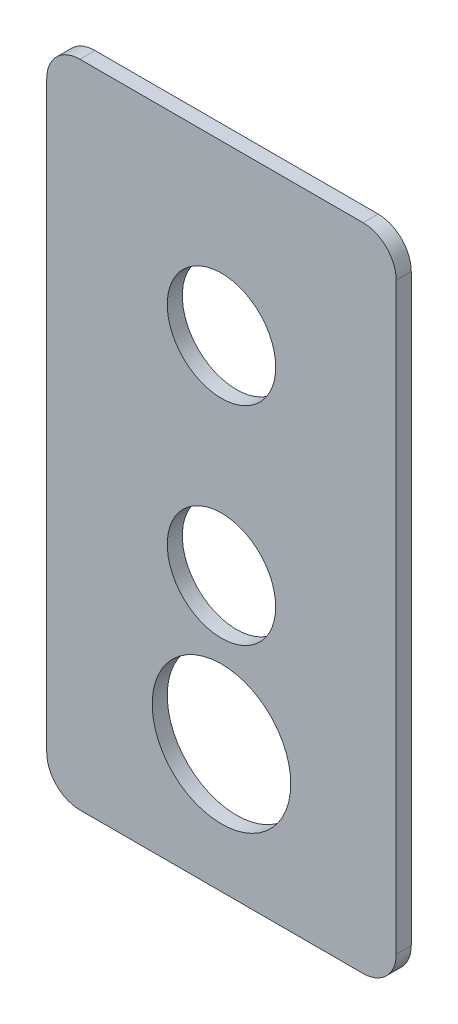
ISO-10303-21;
HEADER;
FILE_DESCRIPTION(('STEP AP214'),'2;1');
FILE_NAME('part.step','',(''),(''),'','','');
FILE_SCHEMA(('AUTOMOTIVE_DESIGN { 1 0 10303 214 1 1 1 1 }'));
ENDSEC;
DATA;
#1=APPLICATION_CONTEXT('core data for automotive mechanical design processes');
#2=APPLICATION_PROTOCOL_DEFINITION('international standard','automotive_design',2000,#1);
#3=PRODUCT_CONTEXT('',#1,'mechanical');
#4=PRODUCT('Part','Part','',(#3));
#5=PRODUCT_RELATED_PRODUCT_CATEGORY('part','',(#4));
#6=PRODUCT_DEFINITION_FORMATION('','',#4);
#7=PRODUCT_DEFINITION_CONTEXT('part definition',#1,'design');
#8=PRODUCT_DEFINITION('design','',#6,#7);
#9=PRODUCT_DEFINITION_SHAPE('','',#8);
#10=(LENGTH_UNIT() NAMED_UNIT(*) SI_UNIT(.MILLI.,.METRE.));
#11=(NAMED_UNIT(*) PLANE_ANGLE_UNIT() SI_UNIT($,.RADIAN.));
#12=(NAMED_UNIT(*) SI_UNIT($,.STERADIAN.) SOLID_ANGLE_UNIT());
#13=UNCERTAINTY_MEASURE_WITH_UNIT(LENGTH_MEASURE(1.E-05),#10,'distance_accuracy_value','');
#14=(GEOMETRIC_REPRESENTATION_CONTEXT(3) GLOBAL_UNCERTAINTY_ASSIGNED_CONTEXT((#13)) GLOBAL_UNIT_ASSIGNED_CONTEXT((#10,
#11,#12)) REPRESENTATION_CONTEXT('',''));
#15=CARTESIAN_POINT('',(0.,0.,0.));
#16=DIRECTION('',(0.,0.,1.));
#17=DIRECTION('',(1.,0.,0.));
#18=AXIS2_PLACEMENT_3D('',#15,#16,#17);
#19=CARTESIAN_POINT('',(-6.96028156084457,107.92,0.772727272727271));
#20=DIRECTION('',(1.,0.,0.));
#21=DIRECTION('',(0.,0.,-1.));
#22=AXIS2_PLACEMENT_3D('',#19,#20,#21);
#23=PLANE('',#22);
#24=DIRECTION('',(0.,-1.,0.));
#25=VECTOR('',#24,1.);
#26=CARTESIAN_POINT('',(-6.96028156084457,107.92,0.772727272727271));
#27=LINE('',#26,#25);
#28=CARTESIAN_POINT('',(-6.96028156084457,102.42,0.772727272727271));
#29=VERTEX_POINT('',#28);
#30=CARTESIAN_POINT('',(-6.96028156084457,5.50000000000001,0.772727272727271));
#31=VERTEX_POINT('',#30);
#32=EDGE_CURVE('E124',#29,#31,#27,.T.);
#33=ORIENTED_EDGE('',*,*,#32,.T.);
#34=DIRECTION('',(0.,0.,1.));
#35=VECTOR('',#34,1.);
#36=CARTESIAN_POINT('',(-6.96028156084457,5.50000000000001,0.772727272727271));
#37=LINE('',#36,#35);
#38=CARTESIAN_POINT('',(-6.96028156084457,5.50000000000001,3.27272727272727));
#39=VERTEX_POINT('',#38);
#40=EDGE_CURVE('E150',#31,#39,#37,.T.);
#41=ORIENTED_EDGE('',*,*,#40,.T.);
#42=DIRECTION('',(0.,-1.,0.));
#43=VECTOR('',#42,1.);
#44=CARTESIAN_POINT('',(-6.96028156084457,107.92,3.27272727272727));
#45=LINE('',#44,#43);
#46=CARTESIAN_POINT('',(-6.96028156084457,102.42,3.27272727272727));
#47=VERTEX_POINT('',#46);
#48=EDGE_CURVE('E128',#47,#39,#45,.T.);
#49=ORIENTED_EDGE('',*,*,#48,.F.);
#50=DIRECTION('',(0.,0.,1.));
#51=VECTOR('',#50,1.);
#52=CARTESIAN_POINT('',(-6.96028156084457,102.42,0.772727272727271));
#53=LINE('',#52,#51);
#54=EDGE_CURVE('E148',#47,#29,#53,.F.);
#55=ORIENTED_EDGE('',*,*,#54,.T.);
#56=EDGE_LOOP('',(#33,#41,#49,#55));
#57=FACE_BOUND('',#56,.T.);
#58=ADVANCED_FACE('F34',(#57),#23,.F.);
#59=CARTESIAN_POINT('',(-6.96028156084457,107.92,3.27272727272727));
#60=DIRECTION('',(0.,0.,-1.));
#61=DIRECTION('',(-1.,0.,0.));
#62=AXIS2_PLACEMENT_3D('',#59,#60,#61);
#63=PLANE('',#62);
#64=CARTESIAN_POINT('',(22.0397184391554,21.2424,3.27272727272727));
#65=DIRECTION('',(0.,0.,1.));
#66=DIRECTION('',(1.,0.,0.));
#67=AXIS2_PLACEMENT_3D('',#64,#65,#66);
#68=CIRCLE('',#67,11.5);
#69=CARTESIAN_POINT('',(33.5397184391554,21.2424,3.27272727272727));
#70=VERTEX_POINT('',#69);
#71=EDGE_CURVE('E197',#70,#70,#68,.T.);
#72=ORIENTED_EDGE('',*,*,#71,.F.);
#73=EDGE_LOOP('',(#72));
#74=FACE_BOUND('',#73,.T.);
#75=CARTESIAN_POINT('',(22.0397184391554,79.92,3.27272727272727));
#76=DIRECTION('',(0.,0.,1.));
#77=DIRECTION('',(1.,0.,0.));
#78=AXIS2_PLACEMENT_3D('',#75,#76,#77);
#79=CIRCLE('',#78,9.);
#80=CARTESIAN_POINT('',(31.0397184391554,79.92,3.27272727272727));
#81=VERTEX_POINT('',#80);
#82=EDGE_CURVE('E156',#81,#81,#79,.T.);
#83=ORIENTED_EDGE('',*,*,#82,.F.);
#84=EDGE_LOOP('',(#83));
#85=FACE_BOUND('',#84,.T.);
#86=CARTESIAN_POINT('',(22.0397184391554,45.4387,3.27272727272727));
#87=DIRECTION('',(0.,0.,1.));
#88=DIRECTION('',(1.,0.,0.));
#89=AXIS2_PLACEMENT_3D('',#86,#87,#88);
#90=CIRCLE('',#89,9.00000000000001);
#91=CARTESIAN_POINT('',(31.0397184391554,45.4387,3.27272727272727));
#92=VERTEX_POINT('',#91);
#93=EDGE_CURVE('E192',#92,#92,#90,.T.);
#94=ORIENTED_EDGE('',*,*,#93,.F.);
#95=EDGE_LOOP('',(#94));
#96=FACE_BOUND('',#95,.T.);
#97=DIRECTION('',(1.,0.,0.));
#98=VECTOR('',#97,1.);
#99=CARTESIAN_POINT('',(-6.96028156084457,0.,3.27272727272727));
#100=LINE('',#99,#98);
#101=CARTESIAN_POINT('',(-1.46028156084457,0.,3.27272727272727));
#102=VERTEX_POINT('',#101);
#103=CARTESIAN_POINT('',(45.5397184391554,0.,3.27272727272727));
#104=VERTEX_POINT('',#103);
#105=EDGE_CURVE('E158',#102,#104,#100,.T.);
#106=ORIENTED_EDGE('',*,*,#105,.T.);
#107=CARTESIAN_POINT('',(45.5397184391554,5.50000000000001,3.27272727272727));
#108=DIRECTION('',(0.,0.,-1.));
#109=DIRECTION('',(-1.,0.,0.));
#110=AXIS2_PLACEMENT_3D('',#107,#108,#109);
#111=CIRCLE('',#110,5.5);
#112=CARTESIAN_POINT('',(51.0397184391554,5.50000000000001,3.27272727272727));
#113=VERTEX_POINT('',#112);
#114=EDGE_CURVE('E146',#104,#113,#111,.F.);
#115=ORIENTED_EDGE('',*,*,#114,.T.);
#116=DIRECTION('',(0.,-1.,0.));
#117=VECTOR('',#116,1.);
#118=CARTESIAN_POINT('',(51.0397184391554,107.92,3.27272727272727));
#119=LINE('',#118,#117);
#120=CARTESIAN_POINT('',(51.0397184391554,102.42,3.27272727272727));
#121=VERTEX_POINT('',#120);
#122=EDGE_CURVE('E123',#121,#113,#119,.T.);
#123=ORIENTED_EDGE('',*,*,#122,.F.);
#124=CARTESIAN_POINT('',(45.5397184391554,102.42,3.27272727272727));
#125=DIRECTION('',(0.,0.,-1.));
#126=DIRECTION('',(-1.,0.,0.));
#127=AXIS2_PLACEMENT_3D('',#124,#125,#126);
#128=CIRCLE('',#127,5.5);
#129=CARTESIAN_POINT('',(45.5397184391554,107.92,3.27272727272727));
#130=VERTEX_POINT('',#129);
#131=EDGE_CURVE('E127',#121,#130,#128,.F.);
#132=ORIENTED_EDGE('',*,*,#131,.T.);
#133=DIRECTION('',(1.,0.,0.));
#134=VECTOR('',#133,1.);
#135=CARTESIAN_POINT('',(-6.96028156084457,107.92,3.27272727272727));
#136=LINE('',#135,#134);
#137=CARTESIAN_POINT('',(-1.46028156084457,107.92,3.27272727272727));
#138=VERTEX_POINT('',#137);
#139=EDGE_CURVE('E167',#138,#130,#136,.T.);
#140=ORIENTED_EDGE('',*,*,#139,.F.);
#141=CARTESIAN_POINT('',(-1.46028156084457,102.42,3.27272727272727));
#142=DIRECTION('',(0.,0.,-1.));
#143=DIRECTION('',(-1.,0.,0.));
#144=AXIS2_PLACEMENT_3D('',#141,#142,#143);
#145=CIRCLE('',#144,5.5);
#146=EDGE_CURVE('E59',#138,#47,#145,.F.);
#147=ORIENTED_EDGE('',*,*,#146,.T.);
#148=ORIENTED_EDGE('',*,*,#48,.T.);
#149=CARTESIAN_POINT('',(-1.46028156084457,5.50000000000001,3.27272727272727));
#150=DIRECTION('',(0.,0.,-1.));
#151=DIRECTION('',(-1.,0.,0.));
#152=AXIS2_PLACEMENT_3D('',#149,#150,#151);
#153=CIRCLE('',#152,5.5);
#154=EDGE_CURVE('E51',#39,#102,#153,.F.);
#155=ORIENTED_EDGE('',*,*,#154,.T.);
#156=EDGE_LOOP('',(#106,#115,#123,#132,#140,#147,#148,#155));
#157=FACE_BOUND('',#156,.T.);
#158=ADVANCED_FACE('F216',(#74,#85,#96,#157),#63,.F.);
#159=CARTESIAN_POINT('',(51.0397184391554,107.92,0.772727272727271));
#160=DIRECTION('',(-1.,0.,0.));
#161=DIRECTION('',(0.,0.,1.));
#162=AXIS2_PLACEMENT_3D('',#159,#160,#161);
#163=PLANE('',#162);
#164=ORIENTED_EDGE('',*,*,#122,.T.);
#165=DIRECTION('',(0.,0.,-1.));
#166=VECTOR('',#165,1.);
#167=CARTESIAN_POINT('',(51.0397184391554,5.50000000000001,0.772727272727271));
#168=LINE('',#167,#166);
#169=CARTESIAN_POINT('',(51.0397184391554,5.50000000000001,0.772727272727271));
#170=VERTEX_POINT('',#169);
#171=EDGE_CURVE('E114',#113,#170,#168,.T.);
#172=ORIENTED_EDGE('',*,*,#171,.T.);
#173=DIRECTION('',(0.,-1.,0.));
#174=VECTOR('',#173,1.);
#175=CARTESIAN_POINT('',(51.0397184391554,107.92,0.772727272727271));
#176=LINE('',#175,#174);
#177=CARTESIAN_POINT('',(51.0397184391554,102.42,0.772727272727271));
#178=VERTEX_POINT('',#177);
#179=EDGE_CURVE('E106',#178,#170,#176,.T.);
#180=ORIENTED_EDGE('',*,*,#179,.F.);
#181=DIRECTION('',(0.,0.,-1.));
#182=VECTOR('',#181,1.);
#183=CARTESIAN_POINT('',(51.0397184391554,102.42,3.27272727272727));
#184=LINE('',#183,#182);
#185=EDGE_CURVE('E120',#178,#121,#184,.F.);
#186=ORIENTED_EDGE('',*,*,#185,.T.);
#187=EDGE_LOOP('',(#164,#172,#180,#186));
#188=FACE_BOUND('',#187,.T.);
#189=ADVANCED_FACE('F119',(#188),#163,.F.);
#190=CARTESIAN_POINT('',(-6.96028156084457,107.92,0.772727272727271));
#191=DIRECTION('',(0.,0.,1.));
#192=DIRECTION('',(1.,0.,0.));
#193=AXIS2_PLACEMENT_3D('',#190,#191,#192);
#194=PLANE('',#193);
#195=CARTESIAN_POINT('',(22.0397184391554,21.2424,0.772727272727272));
#196=DIRECTION('',(0.,0.,1.));
#197=DIRECTION('',(1.,0.,0.));
#198=AXIS2_PLACEMENT_3D('',#195,#196,#197);
#199=CIRCLE('',#198,11.5);
#200=CARTESIAN_POINT('',(33.5397184391554,21.2424,0.772727272727272));
#201=VERTEX_POINT('',#200);
#202=EDGE_CURVE('E38',#201,#201,#199,.T.);
#203=ORIENTED_EDGE('',*,*,#202,.T.);
#204=EDGE_LOOP('',(#203));
#205=FACE_BOUND('',#204,.T.);
#206=CARTESIAN_POINT('',(22.0397184391554,79.92,0.772727272727272));
#207=DIRECTION('',(0.,0.,1.));
#208=DIRECTION('',(1.,0.,0.));
#209=AXIS2_PLACEMENT_3D('',#206,#207,#208);
#210=CIRCLE('',#209,9.);
#211=CARTESIAN_POINT('',(31.0397184391554,79.92,0.772727272727272));
#212=VERTEX_POINT('',#211);
#213=EDGE_CURVE('E155',#212,#212,#210,.T.);
#214=ORIENTED_EDGE('',*,*,#213,.T.);
#215=EDGE_LOOP('',(#214));
#216=FACE_BOUND('',#215,.T.);
#217=CARTESIAN_POINT('',(22.0397184391554,45.4387,0.772727272727272));
#218=DIRECTION('',(0.,0.,1.));
#219=DIRECTION('',(1.,0.,0.));
#220=AXIS2_PLACEMENT_3D('',#217,#218,#219);
#221=CIRCLE('',#220,9.00000000000001);
#222=CARTESIAN_POINT('',(31.0397184391554,45.4387,0.772727272727272));
#223=VERTEX_POINT('',#222);
#224=EDGE_CURVE('E153',#223,#223,#221,.T.);
#225=ORIENTED_EDGE('',*,*,#224,.T.);
#226=EDGE_LOOP('',(#225));
#227=FACE_BOUND('',#226,.T.);
#228=ORIENTED_EDGE('',*,*,#179,.T.);
#229=CARTESIAN_POINT('',(45.5397184391554,5.50000000000001,0.772727272727271));
#230=DIRECTION('',(0.,0.,1.));
#231=DIRECTION('',(1.,0.,0.));
#232=AXIS2_PLACEMENT_3D('',#229,#230,#231);
#233=CIRCLE('',#232,5.5);
#234=CARTESIAN_POINT('',(45.5397184391554,0.,0.772727272727271));
#235=VERTEX_POINT('',#234);
#236=EDGE_CURVE('E137',#170,#235,#233,.F.);
#237=ORIENTED_EDGE('',*,*,#236,.T.);
#238=DIRECTION('',(-1.,0.,0.));
#239=VECTOR('',#238,1.);
#240=CARTESIAN_POINT('',(-6.96028156084457,0.,0.772727272727271));
#241=LINE('',#240,#239);
#242=CARTESIAN_POINT('',(-1.46028156084457,0.,0.772727272727271));
#243=VERTEX_POINT('',#242);
#244=EDGE_CURVE('E162',#235,#243,#241,.T.);
#245=ORIENTED_EDGE('',*,*,#244,.T.);
#246=CARTESIAN_POINT('',(-1.46028156084457,5.50000000000001,0.772727272727271));
#247=DIRECTION('',(0.,0.,1.));
#248=DIRECTION('',(1.,0.,0.));
#249=AXIS2_PLACEMENT_3D('',#246,#247,#248);
#250=CIRCLE('',#249,5.5);
#251=EDGE_CURVE('E135',#243,#31,#250,.F.);
#252=ORIENTED_EDGE('',*,*,#251,.T.);
#253=ORIENTED_EDGE('',*,*,#32,.F.);
#254=CARTESIAN_POINT('',(-1.46028156084457,102.42,0.772727272727271));
#255=DIRECTION('',(0.,0.,1.));
#256=DIRECTION('',(1.,0.,0.));
#257=AXIS2_PLACEMENT_3D('',#254,#255,#256);
#258=CIRCLE('',#257,5.5);
#259=CARTESIAN_POINT('',(-1.46028156084457,107.92,0.772727272727271));
#260=VERTEX_POINT('',#259);
#261=EDGE_CURVE('E113',#29,#260,#258,.F.);
#262=ORIENTED_EDGE('',*,*,#261,.T.);
#263=DIRECTION('',(-1.,0.,0.));
#264=VECTOR('',#263,1.);
#265=CARTESIAN_POINT('',(-6.96028156084457,107.92,0.772727272727271));
#266=LINE('',#265,#264);
#267=CARTESIAN_POINT('',(45.5397184391554,107.92,0.772727272727271));
#268=VERTEX_POINT('',#267);
#269=EDGE_CURVE('E108',#268,#260,#266,.T.);
#270=ORIENTED_EDGE('',*,*,#269,.F.);
#271=CARTESIAN_POINT('',(45.5397184391554,102.42,0.772727272727271));
#272=DIRECTION('',(0.,0.,1.));
#273=DIRECTION('',(1.,0.,0.));
#274=AXIS2_PLACEMENT_3D('',#271,#272,#273);
#275=CIRCLE('',#274,5.5);
#276=EDGE_CURVE('E103',#268,#178,#275,.F.);
#277=ORIENTED_EDGE('',*,*,#276,.T.);
#278=EDGE_LOOP('',(#228,#237,#245,#252,#253,#262,#270,#277));
#279=FACE_BOUND('',#278,.T.);
#280=ADVANCED_FACE('F105',(#205,#216,#227,#279),#194,.F.);
#281=CARTESIAN_POINT('',(0.,107.92,0.));
#282=DIRECTION('',(0.,1.,0.));
#283=DIRECTION('',(0.,0.,1.));
#284=AXIS2_PLACEMENT_3D('',#281,#282,#283);
#285=PLANE('',#284);
#286=ORIENTED_EDGE('',*,*,#269,.T.);
#287=DIRECTION('',(0.,0.,1.));
#288=VECTOR('',#287,1.);
#289=CARTESIAN_POINT('',(-1.46028156084457,107.92,3.27272727272727));
#290=LINE('',#289,#288);
#291=EDGE_CURVE('E11',#260,#138,#290,.T.);
#292=ORIENTED_EDGE('',*,*,#291,.T.);
#293=ORIENTED_EDGE('',*,*,#139,.T.);
#294=DIRECTION('',(0.,0.,-1.));
#295=VECTOR('',#294,1.);
#296=CARTESIAN_POINT('',(45.5397184391554,107.92,0.772727272727271));
#297=LINE('',#296,#295);
#298=EDGE_CURVE('E43',#130,#268,#297,.T.);
#299=ORIENTED_EDGE('',*,*,#298,.T.);
#300=EDGE_LOOP('',(#286,#292,#293,#299));
#301=FACE_BOUND('',#300,.T.);
#302=ADVANCED_FACE('F189',(#301),#285,.T.);
#303=CARTESIAN_POINT('',(0.,0.,0.));
#304=DIRECTION('',(0.,1.,0.));
#305=DIRECTION('',(0.,0.,1.));
#306=AXIS2_PLACEMENT_3D('',#303,#304,#305);
#307=PLANE('',#306);
#308=ORIENTED_EDGE('',*,*,#244,.F.);
#309=DIRECTION('',(0.,0.,-1.));
#310=VECTOR('',#309,1.);
#311=CARTESIAN_POINT('',(45.5397184391554,0.,0.));
#312=LINE('',#311,#310);
#313=EDGE_CURVE('E141',#235,#104,#312,.F.);
#314=ORIENTED_EDGE('',*,*,#313,.T.);
#315=ORIENTED_EDGE('',*,*,#105,.F.);
#316=DIRECTION('',(0.,0.,1.));
#317=VECTOR('',#316,1.);
#318=CARTESIAN_POINT('',(-1.46028156084457,0.,0.));
#319=LINE('',#318,#317);
#320=EDGE_CURVE('E139',#102,#243,#319,.F.);
#321=ORIENTED_EDGE('',*,*,#320,.T.);
#322=EDGE_LOOP('',(#308,#314,#315,#321));
#323=FACE_BOUND('',#322,.T.);
#324=ADVANCED_FACE('F179',(#323),#307,.F.);
#325=CARTESIAN_POINT('',(45.5397184391554,5.50000000000001,0.772727272727271));
#326=DIRECTION('',(0.,0.,-1.));
#327=DIRECTION('',(-1.,0.,0.));
#328=AXIS2_PLACEMENT_3D('',#325,#326,#327);
#329=CYLINDRICAL_SURFACE('',#328,5.5);
#330=ORIENTED_EDGE('',*,*,#114,.F.);
#331=ORIENTED_EDGE('',*,*,#313,.F.);
#332=ORIENTED_EDGE('',*,*,#236,.F.);
#333=ORIENTED_EDGE('',*,*,#171,.F.);
#334=EDGE_LOOP('',(#330,#331,#332,#333));
#335=FACE_BOUND('',#334,.T.);
#336=ADVANCED_FACE('F174',(#335),#329,.T.);
#337=CARTESIAN_POINT('',(-1.46028156084457,5.50000000000001,0.772727272727273));
#338=DIRECTION('',(0.,0.,1.));
#339=DIRECTION('',(1.,0.,0.));
#340=AXIS2_PLACEMENT_3D('',#337,#338,#339);
#341=CYLINDRICAL_SURFACE('',#340,5.5);
#342=ORIENTED_EDGE('',*,*,#251,.F.);
#343=ORIENTED_EDGE('',*,*,#320,.F.);
#344=ORIENTED_EDGE('',*,*,#154,.F.);
#345=ORIENTED_EDGE('',*,*,#40,.F.);
#346=EDGE_LOOP('',(#342,#343,#344,#345));
#347=FACE_BOUND('',#346,.T.);
#348=ADVANCED_FACE('F180',(#347),#341,.T.);
#349=CARTESIAN_POINT('',(-1.46028156084457,102.42,0.));
#350=DIRECTION('',(0.,0.,-1.));
#351=DIRECTION('',(-1.,0.,0.));
#352=AXIS2_PLACEMENT_3D('',#349,#350,#351);
#353=CYLINDRICAL_SURFACE('',#352,5.5);
#354=ORIENTED_EDGE('',*,*,#261,.F.);
#355=ORIENTED_EDGE('',*,*,#54,.F.);
#356=ORIENTED_EDGE('',*,*,#146,.F.);
#357=ORIENTED_EDGE('',*,*,#291,.F.);
#358=EDGE_LOOP('',(#354,#355,#356,#357));
#359=FACE_BOUND('',#358,.T.);
#360=ADVANCED_FACE('F186',(#359),#353,.T.);
#361=CARTESIAN_POINT('',(45.5397184391554,102.42,0.));
#362=DIRECTION('',(0.,0.,1.));
#363=DIRECTION('',(1.,0.,0.));
#364=AXIS2_PLACEMENT_3D('',#361,#362,#363);
#365=CYLINDRICAL_SURFACE('',#364,5.5);
#366=ORIENTED_EDGE('',*,*,#131,.F.);
#367=ORIENTED_EDGE('',*,*,#185,.F.);
#368=ORIENTED_EDGE('',*,*,#276,.F.);
#369=ORIENTED_EDGE('',*,*,#298,.F.);
#370=EDGE_LOOP('',(#366,#367,#368,#369));
#371=FACE_BOUND('',#370,.T.);
#372=ADVANCED_FACE('F36',(#371),#365,.T.);
#373=CARTESIAN_POINT('',(22.0397184391554,45.4387,-108.147272727273));
#374=DIRECTION('',(0.,0.,1.));
#375=DIRECTION('',(1.,0.,0.));
#376=AXIS2_PLACEMENT_3D('',#373,#374,#375);
#377=CYLINDRICAL_SURFACE('',#376,9.00000000000001);
#378=ORIENTED_EDGE('',*,*,#93,.T.);
#379=EDGE_LOOP('',(#378));
#380=FACE_BOUND('',#379,.T.);
#381=ORIENTED_EDGE('',*,*,#224,.F.);
#382=EDGE_LOOP('',(#381));
#383=FACE_BOUND('',#382,.T.);
#384=ADVANCED_FACE('F212',(#380,#383),#377,.F.);
#385=CARTESIAN_POINT('',(22.0397184391554,79.92,-108.147272727273));
#386=DIRECTION('',(0.,0.,1.));
#387=DIRECTION('',(1.,0.,0.));
#388=AXIS2_PLACEMENT_3D('',#385,#386,#387);
#389=CYLINDRICAL_SURFACE('',#388,9.);
#390=ORIENTED_EDGE('',*,*,#82,.T.);
#391=EDGE_LOOP('',(#390));
#392=FACE_BOUND('',#391,.T.);
#393=ORIENTED_EDGE('',*,*,#213,.F.);
#394=EDGE_LOOP('',(#393));
#395=FACE_BOUND('',#394,.T.);
#396=ADVANCED_FACE('F207',(#392,#395),#389,.F.);
#397=CARTESIAN_POINT('',(22.0397184391554,21.2424,-108.147272727273));
#398=DIRECTION('',(0.,0.,1.));
#399=DIRECTION('',(1.,0.,0.));
#400=AXIS2_PLACEMENT_3D('',#397,#398,#399);
#401=CYLINDRICAL_SURFACE('',#400,11.5);
#402=ORIENTED_EDGE('',*,*,#71,.T.);
#403=EDGE_LOOP('',(#402));
#404=FACE_BOUND('',#403,.T.);
#405=ORIENTED_EDGE('',*,*,#202,.F.);
#406=EDGE_LOOP('',(#405));
#407=FACE_BOUND('',#406,.T.);
#408=ADVANCED_FACE('F205',(#404,#407),#401,.F.);
#409=CLOSED_SHELL('',(#58,#158,#189,#280,#302,#324,#336,#348,#360,#372,#384,#396,#408));
#410=MANIFOLD_SOLID_BREP('B2',#409);
#411=ADVANCED_BREP_SHAPE_REPRESENTATION('',(#18,#410),#14);
#412=SHAPE_DEFINITION_REPRESENTATION(#9,#411);
ENDSEC;
END-ISO-10303-21;
